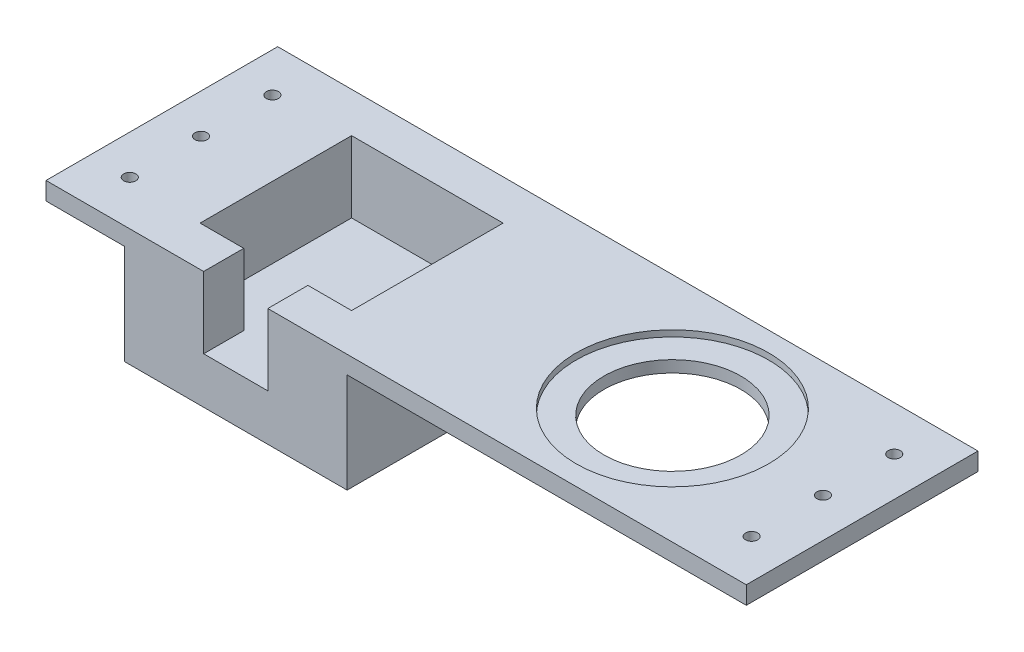
ISO-10303-21;
HEADER;
FILE_DESCRIPTION(('STEP AP214'),'2;1');
FILE_NAME('part.step','',(''),(''),'','','');
FILE_SCHEMA(('AUTOMOTIVE_DESIGN { 1 0 10303 214 1 1 1 1 }'));
ENDSEC;
DATA;
#1=APPLICATION_CONTEXT('core data for automotive mechanical design processes');
#2=APPLICATION_PROTOCOL_DEFINITION('international standard','automotive_design',2000,#1);
#3=PRODUCT_CONTEXT('',#1,'mechanical');
#4=PRODUCT('Part','Part','',(#3));
#5=PRODUCT_RELATED_PRODUCT_CATEGORY('part','',(#4));
#6=PRODUCT_DEFINITION_FORMATION('','',#4);
#7=PRODUCT_DEFINITION_CONTEXT('part definition',#1,'design');
#8=PRODUCT_DEFINITION('design','',#6,#7);
#9=PRODUCT_DEFINITION_SHAPE('','',#8);
#10=(LENGTH_UNIT() NAMED_UNIT(*) SI_UNIT(.MILLI.,.METRE.));
#11=(NAMED_UNIT(*) PLANE_ANGLE_UNIT() SI_UNIT($,.RADIAN.));
#12=(NAMED_UNIT(*) SI_UNIT($,.STERADIAN.) SOLID_ANGLE_UNIT());
#13=UNCERTAINTY_MEASURE_WITH_UNIT(LENGTH_MEASURE(1.E-05),#10,'distance_accuracy_value','');
#14=(GEOMETRIC_REPRESENTATION_CONTEXT(3) GLOBAL_UNCERTAINTY_ASSIGNED_CONTEXT((#13)) GLOBAL_UNIT_ASSIGNED_CONTEXT((#10,
#11,#12)) REPRESENTATION_CONTEXT('',''));
#15=CARTESIAN_POINT('',(0.,0.,0.));
#16=DIRECTION('',(0.,0.,1.));
#17=DIRECTION('',(1.,0.,0.));
#18=AXIS2_PLACEMENT_3D('',#15,#16,#17);
#19=CARTESIAN_POINT('',(0.,0.,0.));
#20=DIRECTION('',(0.,1.,0.));
#21=DIRECTION('',(0.,0.,1.));
#22=AXIS2_PLACEMENT_3D('',#19,#20,#21);
#23=PLANE('',#22);
#24=CARTESIAN_POINT('',(-87.225,0.,-20.));
#25=DIRECTION('',(0.,1.,0.));
#26=DIRECTION('',(0.,0.,1.));
#27=AXIS2_PLACEMENT_3D('',#24,#25,#26);
#28=CIRCLE('',#27,1.69999999999999);
#29=CARTESIAN_POINT('',(-87.225,0.,-18.3));
#30=VERTEX_POINT('',#29);
#31=EDGE_CURVE('E567',#30,#30,#28,.T.);
#32=ORIENTED_EDGE('',*,*,#31,.T.);
#33=EDGE_LOOP('',(#32));
#34=FACE_BOUND('',#33,.T.);
#35=CARTESIAN_POINT('',(-87.225,0.,0.));
#36=DIRECTION('',(0.,1.,0.));
#37=DIRECTION('',(0.,0.,1.));
#38=AXIS2_PLACEMENT_3D('',#35,#36,#37);
#39=CIRCLE('',#38,1.69999999999999);
#40=CARTESIAN_POINT('',(-87.225,0.,1.69999999999999));
#41=VERTEX_POINT('',#40);
#42=EDGE_CURVE('E571',#41,#41,#39,.T.);
#43=ORIENTED_EDGE('',*,*,#42,.T.);
#44=EDGE_LOOP('',(#43));
#45=FACE_BOUND('',#44,.T.);
#46=CARTESIAN_POINT('',(-87.225,0.,20.));
#47=DIRECTION('',(0.,1.,0.));
#48=DIRECTION('',(0.,0.,1.));
#49=AXIS2_PLACEMENT_3D('',#46,#47,#48);
#50=CIRCLE('',#49,1.69999999999999);
#51=CARTESIAN_POINT('',(-87.225,0.,21.7));
#52=VERTEX_POINT('',#51);
#53=EDGE_CURVE('E579',#52,#52,#50,.T.);
#54=ORIENTED_EDGE('',*,*,#53,.T.);
#55=EDGE_LOOP('',(#54));
#56=FACE_BOUND('',#55,.T.);
#57=DIRECTION('',(0.,0.,-1.));
#58=VECTOR('',#57,1.);
#59=CARTESIAN_POINT('',(-76.25,0.,0.));
#60=LINE('',#59,#58);
#61=CARTESIAN_POINT('',(-76.25,0.,32.5));
#62=VERTEX_POINT('',#61);
#63=CARTESIAN_POINT('',(-76.25,0.,-32.5));
#64=VERTEX_POINT('',#63);
#65=EDGE_CURVE('E68',#62,#64,#60,.T.);
#66=ORIENTED_EDGE('',*,*,#65,.F.);
#67=DIRECTION('',(-1.,0.,0.));
#68=VECTOR('',#67,1.);
#69=CARTESIAN_POINT('',(98.225,0.,32.5));
#70=LINE('',#69,#68);
#71=CARTESIAN_POINT('',(-98.225,0.,32.5));
#72=VERTEX_POINT('',#71);
#73=EDGE_CURVE('E276',#62,#72,#70,.T.);
#74=ORIENTED_EDGE('',*,*,#73,.T.);
#75=DIRECTION('',(0.,0.,1.));
#76=VECTOR('',#75,1.);
#77=CARTESIAN_POINT('',(-98.225,0.,-32.5));
#78=LINE('',#77,#76);
#79=CARTESIAN_POINT('',(-98.225,0.,-32.5));
#80=VERTEX_POINT('',#79);
#81=EDGE_CURVE('E273',#80,#72,#78,.T.);
#82=ORIENTED_EDGE('',*,*,#81,.F.);
#83=DIRECTION('',(-1.,0.,0.));
#84=VECTOR('',#83,1.);
#85=CARTESIAN_POINT('',(98.225,0.,-32.5));
#86=LINE('',#85,#84);
#87=EDGE_CURVE('E233',#64,#80,#86,.T.);
#88=ORIENTED_EDGE('',*,*,#87,.F.);
#89=EDGE_LOOP('',(#66,#74,#82,#88));
#90=FACE_BOUND('',#89,.T.);
#91=ADVANCED_FACE('F43',(#34,#45,#56,#90),#23,.F.);
#92=CARTESIAN_POINT('',(98.225,5.,-32.5));
#93=DIRECTION('',(0.,0.,1.));
#94=DIRECTION('',(1.,0.,0.));
#95=AXIS2_PLACEMENT_3D('',#92,#93,#94);
#96=PLANE('',#95);
#97=CARTESIAN_POINT('',(98.225,0.,-32.5));
#98=VERTEX_POINT('',#97);
#99=CARTESIAN_POINT('',(-13.75,0.,-32.5));
#100=VERTEX_POINT('',#99);
#101=EDGE_CURVE('E270',#98,#100,#86,.T.);
#102=ORIENTED_EDGE('',*,*,#101,.T.);
#103=DIRECTION('',(0.,1.,0.));
#104=VECTOR('',#103,1.);
#105=CARTESIAN_POINT('',(-13.75,-28.,-32.5));
#106=LINE('',#105,#104);
#107=CARTESIAN_POINT('',(-13.75,-28.,-32.5));
#108=VERTEX_POINT('',#107);
#109=EDGE_CURVE('E252',#108,#100,#106,.T.);
#110=ORIENTED_EDGE('',*,*,#109,.F.);
#111=DIRECTION('',(-1.,0.,0.));
#112=VECTOR('',#111,1.);
#113=CARTESIAN_POINT('',(0.,-28.,-32.5));
#114=LINE('',#113,#112);
#115=CARTESIAN_POINT('',(-76.25,-28.,-32.5));
#116=VERTEX_POINT('',#115);
#117=EDGE_CURVE('E224',#108,#116,#114,.T.);
#118=ORIENTED_EDGE('',*,*,#117,.T.);
#119=DIRECTION('',(0.,1.,0.));
#120=VECTOR('',#119,1.);
#121=CARTESIAN_POINT('',(-76.25,-28.,-32.5));
#122=LINE('',#121,#120);
#123=EDGE_CURVE('E249',#116,#64,#122,.T.);
#124=ORIENTED_EDGE('',*,*,#123,.T.);
#125=ORIENTED_EDGE('',*,*,#87,.T.);
#126=DIRECTION('',(0.,-1.,0.));
#127=VECTOR('',#126,1.);
#128=CARTESIAN_POINT('',(-98.225,5.,-32.5));
#129=LINE('',#128,#127);
#130=CARTESIAN_POINT('',(-98.225,5.,-32.5));
#131=VERTEX_POINT('',#130);
#132=EDGE_CURVE('E11',#131,#80,#129,.T.);
#133=ORIENTED_EDGE('',*,*,#132,.F.);
#134=DIRECTION('',(-1.,0.,0.));
#135=VECTOR('',#134,1.);
#136=CARTESIAN_POINT('',(98.225,5.,-32.5));
#137=LINE('',#136,#135);
#138=CARTESIAN_POINT('',(98.225,5.,-32.5));
#139=VERTEX_POINT('',#138);
#140=EDGE_CURVE('E257',#139,#131,#137,.T.);
#141=ORIENTED_EDGE('',*,*,#140,.F.);
#142=DIRECTION('',(0.,-1.,0.));
#143=VECTOR('',#142,1.);
#144=CARTESIAN_POINT('',(98.225,5.,-32.5));
#145=LINE('',#144,#143);
#146=EDGE_CURVE('E269',#139,#98,#145,.T.);
#147=ORIENTED_EDGE('',*,*,#146,.T.);
#148=EDGE_LOOP('',(#102,#110,#118,#124,#125,#133,#141,#147));
#149=FACE_BOUND('',#148,.T.);
#150=ADVANCED_FACE('F45',(#149),#96,.F.);
#151=CARTESIAN_POINT('',(-98.225,5.,-32.5));
#152=DIRECTION('',(1.,0.,0.));
#153=DIRECTION('',(0.,0.,-1.));
#154=AXIS2_PLACEMENT_3D('',#151,#152,#153);
#155=PLANE('',#154);
#156=ORIENTED_EDGE('',*,*,#81,.T.);
#157=DIRECTION('',(0.,-1.,0.));
#158=VECTOR('',#157,1.);
#159=CARTESIAN_POINT('',(-98.225,5.,32.5));
#160=LINE('',#159,#158);
#161=CARTESIAN_POINT('',(-98.225,5.,32.5));
#162=VERTEX_POINT('',#161);
#163=EDGE_CURVE('E52',#162,#72,#160,.T.);
#164=ORIENTED_EDGE('',*,*,#163,.F.);
#165=DIRECTION('',(0.,0.,1.));
#166=VECTOR('',#165,1.);
#167=CARTESIAN_POINT('',(-98.225,5.,-32.5));
#168=LINE('',#167,#166);
#169=EDGE_CURVE('E260',#131,#162,#168,.T.);
#170=ORIENTED_EDGE('',*,*,#169,.F.);
#171=ORIENTED_EDGE('',*,*,#132,.T.);
#172=EDGE_LOOP('',(#156,#164,#170,#171));
#173=FACE_BOUND('',#172,.T.);
#174=ADVANCED_FACE('F358',(#173),#155,.F.);
#175=CARTESIAN_POINT('',(98.225,5.,32.5));
#176=DIRECTION('',(0.,0.,1.));
#177=DIRECTION('',(1.,0.,0.));
#178=AXIS2_PLACEMENT_3D('',#175,#176,#177);
#179=PLANE('',#178);
#180=DIRECTION('',(0.,1.,0.));
#181=VECTOR('',#180,1.);
#182=CARTESIAN_POINT('',(-54.,-28.,32.5));
#183=LINE('',#182,#181);
#184=CARTESIAN_POINT('',(-54.,-15.,32.5));
#185=VERTEX_POINT('',#184);
#186=CARTESIAN_POINT('',(-54.,5.,32.5));
#187=VERTEX_POINT('',#186);
#188=EDGE_CURVE('E244',#185,#187,#183,.T.);
#189=ORIENTED_EDGE('',*,*,#188,.T.);
#190=DIRECTION('',(-1.,0.,0.));
#191=VECTOR('',#190,1.);
#192=CARTESIAN_POINT('',(98.225,5.,32.5));
#193=LINE('',#192,#191);
#194=EDGE_CURVE('E264',#187,#162,#193,.T.);
#195=ORIENTED_EDGE('',*,*,#194,.T.);
#196=ORIENTED_EDGE('',*,*,#163,.T.);
#197=ORIENTED_EDGE('',*,*,#73,.F.);
#198=DIRECTION('',(0.,1.,0.));
#199=VECTOR('',#198,1.);
#200=CARTESIAN_POINT('',(-76.25,-28.,32.5));
#201=LINE('',#200,#199);
#202=CARTESIAN_POINT('',(-76.25,-28.,32.5));
#203=VERTEX_POINT('',#202);
#204=EDGE_CURVE('E246',#203,#62,#201,.T.);
#205=ORIENTED_EDGE('',*,*,#204,.F.);
#206=DIRECTION('',(1.,0.,0.));
#207=VECTOR('',#206,1.);
#208=CARTESIAN_POINT('',(0.,-28.,32.5));
#209=LINE('',#208,#207);
#210=CARTESIAN_POINT('',(-13.75,-28.,32.5));
#211=VERTEX_POINT('',#210);
#212=EDGE_CURVE('E165',#203,#211,#209,.T.);
#213=ORIENTED_EDGE('',*,*,#212,.T.);
#214=DIRECTION('',(0.,1.,0.));
#215=VECTOR('',#214,1.);
#216=CARTESIAN_POINT('',(-13.75,-28.,32.5));
#217=LINE('',#216,#215);
#218=CARTESIAN_POINT('',(-13.75,0.,32.5));
#219=VERTEX_POINT('',#218);
#220=EDGE_CURVE('E164',#211,#219,#217,.T.);
#221=ORIENTED_EDGE('',*,*,#220,.T.);
#222=CARTESIAN_POINT('',(98.225,0.,32.5));
#223=VERTEX_POINT('',#222);
#224=EDGE_CURVE('E277',#223,#219,#70,.T.);
#225=ORIENTED_EDGE('',*,*,#224,.F.);
#226=DIRECTION('',(0.,-1.,0.));
#227=VECTOR('',#226,1.);
#228=CARTESIAN_POINT('',(98.225,5.,32.5));
#229=LINE('',#228,#227);
#230=CARTESIAN_POINT('',(98.225,5.,32.5));
#231=VERTEX_POINT('',#230);
#232=EDGE_CURVE('E282',#231,#223,#229,.T.);
#233=ORIENTED_EDGE('',*,*,#232,.F.);
#234=CARTESIAN_POINT('',(-36.,5.,32.5));
#235=VERTEX_POINT('',#234);
#236=EDGE_CURVE('E163',#231,#235,#193,.T.);
#237=ORIENTED_EDGE('',*,*,#236,.T.);
#238=DIRECTION('',(0.,1.,0.));
#239=VECTOR('',#238,1.);
#240=CARTESIAN_POINT('',(-36.,-28.,32.5));
#241=LINE('',#240,#239);
#242=CARTESIAN_POINT('',(-36.,-15.,32.5));
#243=VERTEX_POINT('',#242);
#244=EDGE_CURVE('E60',#243,#235,#241,.T.);
#245=ORIENTED_EDGE('',*,*,#244,.F.);
#246=DIRECTION('',(1.,0.,0.));
#247=VECTOR('',#246,1.);
#248=CARTESIAN_POINT('',(0.,-15.,32.5));
#249=LINE('',#248,#247);
#250=EDGE_CURVE('E161',#185,#243,#249,.T.);
#251=ORIENTED_EDGE('',*,*,#250,.F.);
#252=EDGE_LOOP('',(#189,#195,#196,#197,#205,#213,#221,#225,#233,#237,#245,#251));
#253=FACE_BOUND('',#252,.T.);
#254=ADVANCED_FACE('F159',(#253),#179,.T.);
#255=CARTESIAN_POINT('',(98.225,5.,-32.5));
#256=DIRECTION('',(1.,0.,0.));
#257=DIRECTION('',(0.,0.,-1.));
#258=AXIS2_PLACEMENT_3D('',#255,#256,#257);
#259=PLANE('',#258);
#260=DIRECTION('',(0.,0.,1.));
#261=VECTOR('',#260,1.);
#262=CARTESIAN_POINT('',(98.225,0.,-32.5));
#263=LINE('',#262,#261);
#264=EDGE_CURVE('E261',#98,#223,#263,.T.);
#265=ORIENTED_EDGE('',*,*,#264,.F.);
#266=ORIENTED_EDGE('',*,*,#146,.F.);
#267=DIRECTION('',(0.,0.,1.));
#268=VECTOR('',#267,1.);
#269=CARTESIAN_POINT('',(98.225,5.,-32.5));
#270=LINE('',#269,#268);
#271=EDGE_CURVE('E266',#139,#231,#270,.T.);
#272=ORIENTED_EDGE('',*,*,#271,.T.);
#273=ORIENTED_EDGE('',*,*,#232,.T.);
#274=EDGE_LOOP('',(#265,#266,#272,#273));
#275=FACE_BOUND('',#274,.T.);
#276=ADVANCED_FACE('F322',(#275),#259,.T.);
#277=CARTESIAN_POINT('',(0.,5.,0.));
#278=DIRECTION('',(0.,1.,0.));
#279=DIRECTION('',(0.,0.,1.));
#280=AXIS2_PLACEMENT_3D('',#277,#278,#279);
#281=PLANE('',#280);
#282=CARTESIAN_POINT('',(-87.225,5.,-20.));
#283=DIRECTION('',(0.,1.,0.));
#284=DIRECTION('',(0.,0.,1.));
#285=AXIS2_PLACEMENT_3D('',#282,#283,#284);
#286=CIRCLE('',#285,1.69999999999999);
#287=CARTESIAN_POINT('',(-87.225,5.,-18.3));
#288=VERTEX_POINT('',#287);
#289=EDGE_CURVE('E565',#288,#288,#286,.T.);
#290=ORIENTED_EDGE('',*,*,#289,.F.);
#291=EDGE_LOOP('',(#290));
#292=FACE_BOUND('',#291,.T.);
#293=CARTESIAN_POINT('',(-87.225,5.,0.));
#294=DIRECTION('',(0.,1.,0.));
#295=DIRECTION('',(0.,0.,1.));
#296=AXIS2_PLACEMENT_3D('',#293,#294,#295);
#297=CIRCLE('',#296,1.69999999999999);
#298=CARTESIAN_POINT('',(-87.225,5.,1.69999999999999));
#299=VERTEX_POINT('',#298);
#300=EDGE_CURVE('E568',#299,#299,#297,.T.);
#301=ORIENTED_EDGE('',*,*,#300,.F.);
#302=EDGE_LOOP('',(#301));
#303=FACE_BOUND('',#302,.T.);
#304=CARTESIAN_POINT('',(-87.225,5.,20.));
#305=DIRECTION('',(0.,1.,0.));
#306=DIRECTION('',(0.,0.,1.));
#307=AXIS2_PLACEMENT_3D('',#304,#305,#306);
#308=CIRCLE('',#307,1.69999999999999);
#309=CARTESIAN_POINT('',(-87.225,5.,21.7));
#310=VERTEX_POINT('',#309);
#311=EDGE_CURVE('E577',#310,#310,#308,.T.);
#312=ORIENTED_EDGE('',*,*,#311,.F.);
#313=EDGE_LOOP('',(#312));
#314=FACE_BOUND('',#313,.T.);
#315=CARTESIAN_POINT('',(87.225,5.,20.));
#316=DIRECTION('',(0.,1.,0.));
#317=DIRECTION('',(0.,0.,1.));
#318=AXIS2_PLACEMENT_3D('',#315,#316,#317);
#319=CIRCLE('',#318,1.69999999999999);
#320=CARTESIAN_POINT('',(87.225,5.,21.7));
#321=VERTEX_POINT('',#320);
#322=EDGE_CURVE('E305',#321,#321,#319,.T.);
#323=ORIENTED_EDGE('',*,*,#322,.F.);
#324=EDGE_LOOP('',(#323));
#325=FACE_BOUND('',#324,.T.);
#326=CARTESIAN_POINT('',(87.225,5.,0.));
#327=DIRECTION('',(0.,1.,0.));
#328=DIRECTION('',(0.,0.,1.));
#329=AXIS2_PLACEMENT_3D('',#326,#327,#328);
#330=CIRCLE('',#329,1.69999999999999);
#331=CARTESIAN_POINT('',(87.225,5.,1.69999999999998));
#332=VERTEX_POINT('',#331);
#333=EDGE_CURVE('E295',#332,#332,#330,.T.);
#334=ORIENTED_EDGE('',*,*,#333,.F.);
#335=EDGE_LOOP('',(#334));
#336=FACE_BOUND('',#335,.T.);
#337=CARTESIAN_POINT('',(87.225,5.,-20.));
#338=DIRECTION('',(0.,1.,0.));
#339=DIRECTION('',(0.,0.,1.));
#340=AXIS2_PLACEMENT_3D('',#337,#338,#339);
#341=CIRCLE('',#340,1.69999999999999);
#342=CARTESIAN_POINT('',(87.225,5.,-18.3));
#343=VERTEX_POINT('',#342);
#344=EDGE_CURVE('E292',#343,#343,#341,.T.);
#345=ORIENTED_EDGE('',*,*,#344,.F.);
#346=EDGE_LOOP('',(#345));
#347=FACE_BOUND('',#346,.T.);
#348=CARTESIAN_POINT('',(45.,5.,0.));
#349=DIRECTION('',(0.,1.,0.));
#350=DIRECTION('',(0.,0.,1.));
#351=AXIS2_PLACEMENT_3D('',#348,#349,#350);
#352=CIRCLE('',#351,26.99);
#353=CARTESIAN_POINT('',(45.,5.,26.99));
#354=VERTEX_POINT('',#353);
#355=EDGE_CURVE('E187',#354,#354,#352,.T.);
#356=ORIENTED_EDGE('',*,*,#355,.F.);
#357=EDGE_LOOP('',(#356));
#358=FACE_BOUND('',#357,.T.);
#359=DIRECTION('',(0.,0.,1.));
#360=VECTOR('',#359,1.);
#361=CARTESIAN_POINT('',(-54.,5.,0.));
#362=LINE('',#361,#360);
#363=CARTESIAN_POINT('',(-54.,5.,21.25));
#364=VERTEX_POINT('',#363);
#365=EDGE_CURVE('E181',#364,#187,#362,.T.);
#366=ORIENTED_EDGE('',*,*,#365,.F.);
#367=DIRECTION('',(1.,0.,0.));
#368=VECTOR('',#367,1.);
#369=CARTESIAN_POINT('',(0.,5.,21.25));
#370=LINE('',#369,#368);
#371=CARTESIAN_POINT('',(-66.25,5.,21.25));
#372=VERTEX_POINT('',#371);
#373=EDGE_CURVE('E184',#372,#364,#370,.T.);
#374=ORIENTED_EDGE('',*,*,#373,.F.);
#375=DIRECTION('',(0.,0.,1.));
#376=VECTOR('',#375,1.);
#377=CARTESIAN_POINT('',(-66.25,5.,0.));
#378=LINE('',#377,#376);
#379=CARTESIAN_POINT('',(-66.25,5.,-21.25));
#380=VERTEX_POINT('',#379);
#381=EDGE_CURVE('E216',#380,#372,#378,.T.);
#382=ORIENTED_EDGE('',*,*,#381,.F.);
#383=DIRECTION('',(-1.,0.,0.));
#384=VECTOR('',#383,1.);
#385=CARTESIAN_POINT('',(0.,5.,-21.25));
#386=LINE('',#385,#384);
#387=CARTESIAN_POINT('',(-23.75,5.,-21.25));
#388=VERTEX_POINT('',#387);
#389=EDGE_CURVE('E213',#388,#380,#386,.T.);
#390=ORIENTED_EDGE('',*,*,#389,.F.);
#391=DIRECTION('',(0.,0.,-1.));
#392=VECTOR('',#391,1.);
#393=CARTESIAN_POINT('',(-23.75,5.,0.));
#394=LINE('',#393,#392);
#395=CARTESIAN_POINT('',(-23.75,5.,21.25));
#396=VERTEX_POINT('',#395);
#397=EDGE_CURVE('E210',#396,#388,#394,.T.);
#398=ORIENTED_EDGE('',*,*,#397,.F.);
#399=DIRECTION('',(1.,0.,0.));
#400=VECTOR('',#399,1.);
#401=CARTESIAN_POINT('',(0.,5.,21.25));
#402=LINE('',#401,#400);
#403=CARTESIAN_POINT('',(-36.,5.,21.25));
#404=VERTEX_POINT('',#403);
#405=EDGE_CURVE('E206',#404,#396,#402,.T.);
#406=ORIENTED_EDGE('',*,*,#405,.F.);
#407=DIRECTION('',(0.,0.,-1.));
#408=VECTOR('',#407,1.);
#409=CARTESIAN_POINT('',(-36.,5.,0.));
#410=LINE('',#409,#408);
#411=EDGE_CURVE('E204',#235,#404,#410,.T.);
#412=ORIENTED_EDGE('',*,*,#411,.F.);
#413=ORIENTED_EDGE('',*,*,#236,.F.);
#414=ORIENTED_EDGE('',*,*,#271,.F.);
#415=ORIENTED_EDGE('',*,*,#140,.T.);
#416=ORIENTED_EDGE('',*,*,#169,.T.);
#417=ORIENTED_EDGE('',*,*,#194,.F.);
#418=EDGE_LOOP('',(#366,#374,#382,#390,#398,#406,#412,#413,#414,#415,#416,#417));
#419=FACE_BOUND('',#418,.T.);
#420=ADVANCED_FACE('F318',(#292,#303,#314,#325,#336,#347,#358,#419),#281,.T.);
#421=CARTESIAN_POINT('',(87.225,0.,20.));
#422=DIRECTION('',(0.,1.,0.));
#423=DIRECTION('',(0.,0.,1.));
#424=AXIS2_PLACEMENT_3D('',#421,#422,#423);
#425=CIRCLE('',#424,1.69999999999999);
#426=CARTESIAN_POINT('',(87.225,0.,21.7));
#427=VERTEX_POINT('',#426);
#428=EDGE_CURVE('E47',#427,#427,#425,.T.);
#429=ORIENTED_EDGE('',*,*,#428,.T.);
#430=EDGE_LOOP('',(#429));
#431=FACE_BOUND('',#430,.T.);
#432=CARTESIAN_POINT('',(87.225,0.,0.));
#433=DIRECTION('',(0.,1.,0.));
#434=DIRECTION('',(0.,0.,1.));
#435=AXIS2_PLACEMENT_3D('',#432,#433,#434);
#436=CIRCLE('',#435,1.69999999999999);
#437=CARTESIAN_POINT('',(87.225,0.,1.69999999999998));
#438=VERTEX_POINT('',#437);
#439=EDGE_CURVE('E293',#438,#438,#436,.T.);
#440=ORIENTED_EDGE('',*,*,#439,.T.);
#441=EDGE_LOOP('',(#440));
#442=FACE_BOUND('',#441,.T.);
#443=CARTESIAN_POINT('',(87.225,0.,-20.));
#444=DIRECTION('',(0.,1.,0.));
#445=DIRECTION('',(0.,0.,1.));
#446=AXIS2_PLACEMENT_3D('',#443,#444,#445);
#447=CIRCLE('',#446,1.69999999999999);
#448=CARTESIAN_POINT('',(87.225,0.,-18.3));
#449=VERTEX_POINT('',#448);
#450=EDGE_CURVE('E290',#449,#449,#447,.T.);
#451=ORIENTED_EDGE('',*,*,#450,.T.);
#452=EDGE_LOOP('',(#451));
#453=FACE_BOUND('',#452,.T.);
#454=CARTESIAN_POINT('',(45.,0.,0.));
#455=DIRECTION('',(0.,1.,0.));
#456=DIRECTION('',(0.,0.,1.));
#457=AXIS2_PLACEMENT_3D('',#454,#455,#456);
#458=CIRCLE('',#457,19.2);
#459=CARTESIAN_POINT('',(45.,0.,19.2));
#460=VERTEX_POINT('',#459);
#461=EDGE_CURVE('E289',#460,#460,#458,.T.);
#462=ORIENTED_EDGE('',*,*,#461,.T.);
#463=EDGE_LOOP('',(#462));
#464=FACE_BOUND('',#463,.T.);
#465=ORIENTED_EDGE('',*,*,#224,.T.);
#466=DIRECTION('',(0.,0.,-1.));
#467=VECTOR('',#466,1.);
#468=CARTESIAN_POINT('',(-13.75,0.,0.));
#469=LINE('',#468,#467);
#470=EDGE_CURVE('E203',#219,#100,#469,.T.);
#471=ORIENTED_EDGE('',*,*,#470,.T.);
#472=ORIENTED_EDGE('',*,*,#101,.F.);
#473=ORIENTED_EDGE('',*,*,#264,.T.);
#474=EDGE_LOOP('',(#465,#471,#472,#473));
#475=FACE_BOUND('',#474,.T.);
#476=ADVANCED_FACE('F321',(#431,#442,#453,#464,#475),#23,.F.);
#477=CARTESIAN_POINT('',(-36.,-28.,0.));
#478=DIRECTION('',(1.,0.,0.));
#479=DIRECTION('',(0.,0.,-1.));
#480=AXIS2_PLACEMENT_3D('',#477,#478,#479);
#481=PLANE('',#480);
#482=DIRECTION('',(0.,1.,0.));
#483=VECTOR('',#482,1.);
#484=CARTESIAN_POINT('',(-36.,-28.,21.25));
#485=LINE('',#484,#483);
#486=CARTESIAN_POINT('',(-36.,-15.,21.25));
#487=VERTEX_POINT('',#486);
#488=EDGE_CURVE('E170',#487,#404,#485,.T.);
#489=ORIENTED_EDGE('',*,*,#488,.F.);
#490=DIRECTION('',(0.,0.,-1.));
#491=VECTOR('',#490,1.);
#492=CARTESIAN_POINT('',(-36.,-15.,0.));
#493=LINE('',#492,#491);
#494=EDGE_CURVE('E168',#243,#487,#493,.T.);
#495=ORIENTED_EDGE('',*,*,#494,.F.);
#496=ORIENTED_EDGE('',*,*,#244,.T.);
#497=ORIENTED_EDGE('',*,*,#411,.T.);
#498=EDGE_LOOP('',(#489,#495,#496,#497));
#499=FACE_BOUND('',#498,.T.);
#500=ADVANCED_FACE('F169',(#499),#481,.F.);
#501=CARTESIAN_POINT('',(0.,-28.,21.25));
#502=DIRECTION('',(0.,0.,1.));
#503=DIRECTION('',(1.,0.,0.));
#504=AXIS2_PLACEMENT_3D('',#501,#502,#503);
#505=PLANE('',#504);
#506=DIRECTION('',(0.,1.,0.));
#507=VECTOR('',#506,1.);
#508=CARTESIAN_POINT('',(-23.75,-28.,21.25));
#509=LINE('',#508,#507);
#510=CARTESIAN_POINT('',(-23.75,-15.,21.25));
#511=VERTEX_POINT('',#510);
#512=EDGE_CURVE('E234',#511,#396,#509,.T.);
#513=ORIENTED_EDGE('',*,*,#512,.F.);
#514=DIRECTION('',(1.,0.,0.));
#515=VECTOR('',#514,1.);
#516=CARTESIAN_POINT('',(0.,-15.,21.25));
#517=LINE('',#516,#515);
#518=EDGE_CURVE('E174',#487,#511,#517,.T.);
#519=ORIENTED_EDGE('',*,*,#518,.F.);
#520=ORIENTED_EDGE('',*,*,#488,.T.);
#521=ORIENTED_EDGE('',*,*,#405,.T.);
#522=EDGE_LOOP('',(#513,#519,#520,#521));
#523=FACE_BOUND('',#522,.T.);
#524=ADVANCED_FACE('F347',(#523),#505,.F.);
#525=CARTESIAN_POINT('',(-23.75,-28.,0.));
#526=DIRECTION('',(1.,0.,0.));
#527=DIRECTION('',(0.,0.,-1.));
#528=AXIS2_PLACEMENT_3D('',#525,#526,#527);
#529=PLANE('',#528);
#530=DIRECTION('',(0.,1.,0.));
#531=VECTOR('',#530,1.);
#532=CARTESIAN_POINT('',(-23.75,-28.,-21.25));
#533=LINE('',#532,#531);
#534=CARTESIAN_POINT('',(-23.75,-15.,-21.25));
#535=VERTEX_POINT('',#534);
#536=EDGE_CURVE('E236',#535,#388,#533,.T.);
#537=ORIENTED_EDGE('',*,*,#536,.F.);
#538=DIRECTION('',(0.,0.,-1.));
#539=VECTOR('',#538,1.);
#540=CARTESIAN_POINT('',(-23.75,-15.,0.));
#541=LINE('',#540,#539);
#542=EDGE_CURVE('E191',#511,#535,#541,.T.);
#543=ORIENTED_EDGE('',*,*,#542,.F.);
#544=ORIENTED_EDGE('',*,*,#512,.T.);
#545=ORIENTED_EDGE('',*,*,#397,.T.);
#546=EDGE_LOOP('',(#537,#543,#544,#545));
#547=FACE_BOUND('',#546,.T.);
#548=ADVANCED_FACE('F345',(#547),#529,.F.);
#549=CARTESIAN_POINT('',(0.,-28.,-21.25));
#550=DIRECTION('',(0.,0.,1.));
#551=DIRECTION('',(1.,0.,0.));
#552=AXIS2_PLACEMENT_3D('',#549,#550,#551);
#553=PLANE('',#552);
#554=DIRECTION('',(0.,1.,0.));
#555=VECTOR('',#554,1.);
#556=CARTESIAN_POINT('',(-66.25,-28.,-21.25));
#557=LINE('',#556,#555);
#558=CARTESIAN_POINT('',(-66.25,-15.,-21.25));
#559=VERTEX_POINT('',#558);
#560=EDGE_CURVE('E238',#559,#380,#557,.T.);
#561=ORIENTED_EDGE('',*,*,#560,.F.);
#562=DIRECTION('',(-1.,0.,0.));
#563=VECTOR('',#562,1.);
#564=CARTESIAN_POINT('',(0.,-15.,-21.25));
#565=LINE('',#564,#563);
#566=EDGE_CURVE('E194',#535,#559,#565,.T.);
#567=ORIENTED_EDGE('',*,*,#566,.F.);
#568=ORIENTED_EDGE('',*,*,#536,.T.);
#569=ORIENTED_EDGE('',*,*,#389,.T.);
#570=EDGE_LOOP('',(#561,#567,#568,#569));
#571=FACE_BOUND('',#570,.T.);
#572=ADVANCED_FACE('F341',(#571),#553,.T.);
#573=CARTESIAN_POINT('',(-66.25,-28.,0.));
#574=DIRECTION('',(1.,0.,0.));
#575=DIRECTION('',(0.,0.,-1.));
#576=AXIS2_PLACEMENT_3D('',#573,#574,#575);
#577=PLANE('',#576);
#578=DIRECTION('',(0.,1.,0.));
#579=VECTOR('',#578,1.);
#580=CARTESIAN_POINT('',(-66.25,-28.,21.25));
#581=LINE('',#580,#579);
#582=CARTESIAN_POINT('',(-66.25,-15.,21.25));
#583=VERTEX_POINT('',#582);
#584=EDGE_CURVE('E240',#583,#372,#581,.T.);
#585=ORIENTED_EDGE('',*,*,#584,.F.);
#586=DIRECTION('',(0.,0.,1.));
#587=VECTOR('',#586,1.);
#588=CARTESIAN_POINT('',(-66.25,-15.,0.));
#589=LINE('',#588,#587);
#590=EDGE_CURVE('E197',#559,#583,#589,.T.);
#591=ORIENTED_EDGE('',*,*,#590,.F.);
#592=ORIENTED_EDGE('',*,*,#560,.T.);
#593=ORIENTED_EDGE('',*,*,#381,.T.);
#594=EDGE_LOOP('',(#585,#591,#592,#593));
#595=FACE_BOUND('',#594,.T.);
#596=ADVANCED_FACE('F336',(#595),#577,.T.);
#597=CARTESIAN_POINT('',(0.,-28.,21.25));
#598=DIRECTION('',(0.,0.,1.));
#599=DIRECTION('',(1.,0.,0.));
#600=AXIS2_PLACEMENT_3D('',#597,#598,#599);
#601=PLANE('',#600);
#602=DIRECTION('',(0.,1.,0.));
#603=VECTOR('',#602,1.);
#604=CARTESIAN_POINT('',(-54.,-28.,21.25));
#605=LINE('',#604,#603);
#606=CARTESIAN_POINT('',(-54.,-15.,21.25));
#607=VERTEX_POINT('',#606);
#608=EDGE_CURVE('E242',#607,#364,#605,.T.);
#609=ORIENTED_EDGE('',*,*,#608,.F.);
#610=DIRECTION('',(1.,0.,0.));
#611=VECTOR('',#610,1.);
#612=CARTESIAN_POINT('',(0.,-15.,21.25));
#613=LINE('',#612,#611);
#614=EDGE_CURVE('E200',#583,#607,#613,.T.);
#615=ORIENTED_EDGE('',*,*,#614,.F.);
#616=ORIENTED_EDGE('',*,*,#584,.T.);
#617=ORIENTED_EDGE('',*,*,#373,.T.);
#618=EDGE_LOOP('',(#609,#615,#616,#617));
#619=FACE_BOUND('',#618,.T.);
#620=ADVANCED_FACE('F333',(#619),#601,.F.);
#621=CARTESIAN_POINT('',(-54.,-28.,0.));
#622=DIRECTION('',(-1.,0.,0.));
#623=DIRECTION('',(0.,0.,1.));
#624=AXIS2_PLACEMENT_3D('',#621,#622,#623);
#625=PLANE('',#624);
#626=ORIENTED_EDGE('',*,*,#188,.F.);
#627=DIRECTION('',(0.,0.,1.));
#628=VECTOR('',#627,1.);
#629=CARTESIAN_POINT('',(-54.,-15.,0.));
#630=LINE('',#629,#628);
#631=EDGE_CURVE('E180',#607,#185,#630,.T.);
#632=ORIENTED_EDGE('',*,*,#631,.F.);
#633=ORIENTED_EDGE('',*,*,#608,.T.);
#634=ORIENTED_EDGE('',*,*,#365,.T.);
#635=EDGE_LOOP('',(#626,#632,#633,#634));
#636=FACE_BOUND('',#635,.T.);
#637=ADVANCED_FACE('F330',(#636),#625,.F.);
#638=CARTESIAN_POINT('',(-76.25,-28.,0.));
#639=DIRECTION('',(1.,0.,0.));
#640=DIRECTION('',(0.,0.,-1.));
#641=AXIS2_PLACEMENT_3D('',#638,#639,#640);
#642=PLANE('',#641);
#643=ORIENTED_EDGE('',*,*,#65,.T.);
#644=ORIENTED_EDGE('',*,*,#123,.F.);
#645=DIRECTION('',(0.,0.,-1.));
#646=VECTOR('',#645,1.);
#647=CARTESIAN_POINT('',(-76.25,-28.,0.));
#648=LINE('',#647,#646);
#649=EDGE_CURVE('E227',#203,#116,#648,.T.);
#650=ORIENTED_EDGE('',*,*,#649,.F.);
#651=ORIENTED_EDGE('',*,*,#204,.T.);
#652=EDGE_LOOP('',(#643,#644,#650,#651));
#653=FACE_BOUND('',#652,.T.);
#654=ADVANCED_FACE('F362',(#653),#642,.F.);
#655=CARTESIAN_POINT('',(-13.75,-28.,0.));
#656=DIRECTION('',(1.,0.,0.));
#657=DIRECTION('',(0.,0.,-1.));
#658=AXIS2_PLACEMENT_3D('',#655,#656,#657);
#659=PLANE('',#658);
#660=ORIENTED_EDGE('',*,*,#470,.F.);
#661=ORIENTED_EDGE('',*,*,#220,.F.);
#662=DIRECTION('',(0.,0.,-1.));
#663=VECTOR('',#662,1.);
#664=CARTESIAN_POINT('',(-13.75,-28.,0.));
#665=LINE('',#664,#663);
#666=EDGE_CURVE('E221',#211,#108,#665,.T.);
#667=ORIENTED_EDGE('',*,*,#666,.T.);
#668=ORIENTED_EDGE('',*,*,#109,.T.);
#669=EDGE_LOOP('',(#660,#661,#667,#668));
#670=FACE_BOUND('',#669,.T.);
#671=ADVANCED_FACE('F372',(#670),#659,.T.);
#672=CARTESIAN_POINT('',(0.,-28.,0.));
#673=DIRECTION('',(0.,1.,0.));
#674=DIRECTION('',(0.,0.,1.));
#675=AXIS2_PLACEMENT_3D('',#672,#673,#674);
#676=PLANE('',#675);
#677=ORIENTED_EDGE('',*,*,#666,.F.);
#678=ORIENTED_EDGE('',*,*,#212,.F.);
#679=ORIENTED_EDGE('',*,*,#649,.T.);
#680=ORIENTED_EDGE('',*,*,#117,.F.);
#681=EDGE_LOOP('',(#677,#678,#679,#680));
#682=FACE_BOUND('',#681,.T.);
#683=ADVANCED_FACE('F368',(#682),#676,.F.);
#684=CARTESIAN_POINT('',(0.,-15.,0.));
#685=DIRECTION('',(0.,1.,0.));
#686=DIRECTION('',(0.,0.,1.));
#687=AXIS2_PLACEMENT_3D('',#684,#685,#686);
#688=PLANE('',#687);
#689=ORIENTED_EDGE('',*,*,#250,.T.);
#690=ORIENTED_EDGE('',*,*,#494,.T.);
#691=ORIENTED_EDGE('',*,*,#518,.T.);
#692=ORIENTED_EDGE('',*,*,#542,.T.);
#693=ORIENTED_EDGE('',*,*,#566,.T.);
#694=ORIENTED_EDGE('',*,*,#590,.T.);
#695=ORIENTED_EDGE('',*,*,#614,.T.);
#696=ORIENTED_EDGE('',*,*,#631,.T.);
#697=EDGE_LOOP('',(#689,#690,#691,#692,#693,#694,#695,#696));
#698=FACE_BOUND('',#697,.T.);
#699=ADVANCED_FACE('F177',(#698),#688,.T.);
#700=CARTESIAN_POINT('',(45.,3.26,0.));
#701=DIRECTION('',(0.,1.,0.));
#702=DIRECTION('',(0.,0.,1.));
#703=AXIS2_PLACEMENT_3D('',#700,#701,#702);
#704=CYLINDRICAL_SURFACE('',#703,26.99);
#705=CARTESIAN_POINT('',(45.,3.26,0.));
#706=DIRECTION('',(0.,1.,0.));
#707=DIRECTION('',(0.,0.,1.));
#708=AXIS2_PLACEMENT_3D('',#705,#706,#707);
#709=CIRCLE('',#708,26.99);
#710=CARTESIAN_POINT('',(45.,3.26,26.99));
#711=VERTEX_POINT('',#710);
#712=EDGE_CURVE('E207',#711,#711,#709,.T.);
#713=ORIENTED_EDGE('',*,*,#712,.F.);
#714=EDGE_LOOP('',(#713));
#715=FACE_BOUND('',#714,.T.);
#716=ORIENTED_EDGE('',*,*,#355,.T.);
#717=EDGE_LOOP('',(#716));
#718=FACE_BOUND('',#717,.T.);
#719=ADVANCED_FACE('F316',(#715,#718),#704,.F.);
#720=CARTESIAN_POINT('',(45.,3.26,0.));
#721=DIRECTION('',(0.,1.,0.));
#722=DIRECTION('',(0.,0.,1.));
#723=AXIS2_PLACEMENT_3D('',#720,#721,#722);
#724=PLANE('',#723);
#725=CARTESIAN_POINT('',(45.,3.26,0.));
#726=DIRECTION('',(0.,1.,0.));
#727=DIRECTION('',(0.,0.,1.));
#728=AXIS2_PLACEMENT_3D('',#725,#726,#727);
#729=CIRCLE('',#728,19.2);
#730=CARTESIAN_POINT('',(45.,3.26,19.2));
#731=VERTEX_POINT('',#730);
#732=EDGE_CURVE('E286',#731,#731,#729,.F.);
#733=ORIENTED_EDGE('',*,*,#732,.T.);
#734=EDGE_LOOP('',(#733));
#735=FACE_BOUND('',#734,.T.);
#736=ORIENTED_EDGE('',*,*,#712,.T.);
#737=EDGE_LOOP('',(#736));
#738=FACE_BOUND('',#737,.T.);
#739=ADVANCED_FACE('F399',(#735,#738),#724,.T.);
#740=CARTESIAN_POINT('',(45.,20.,0.));
#741=DIRECTION('',(0.,-1.,0.));
#742=DIRECTION('',(0.,0.,-1.));
#743=AXIS2_PLACEMENT_3D('',#740,#741,#742);
#744=CYLINDRICAL_SURFACE('',#743,19.2);
#745=ORIENTED_EDGE('',*,*,#732,.F.);
#746=EDGE_LOOP('',(#745));
#747=FACE_BOUND('',#746,.T.);
#748=ORIENTED_EDGE('',*,*,#461,.F.);
#749=EDGE_LOOP('',(#748));
#750=FACE_BOUND('',#749,.T.);
#751=ADVANCED_FACE('F397',(#747,#750),#744,.F.);
#752=CARTESIAN_POINT('',(87.225,5.,-20.));
#753=DIRECTION('',(0.,1.,0.));
#754=DIRECTION('',(0.,0.,1.));
#755=AXIS2_PLACEMENT_3D('',#752,#753,#754);
#756=CYLINDRICAL_SURFACE('',#755,1.69999999999999);
#757=ORIENTED_EDGE('',*,*,#344,.T.);
#758=EDGE_LOOP('',(#757));
#759=FACE_BOUND('',#758,.T.);
#760=ORIENTED_EDGE('',*,*,#450,.F.);
#761=EDGE_LOOP('',(#760));
#762=FACE_BOUND('',#761,.T.);
#763=ADVANCED_FACE('F398',(#759,#762),#756,.F.);
#764=CARTESIAN_POINT('',(87.225,5.,0.));
#765=DIRECTION('',(0.,1.,0.));
#766=DIRECTION('',(0.,0.,1.));
#767=AXIS2_PLACEMENT_3D('',#764,#765,#766);
#768=CYLINDRICAL_SURFACE('',#767,1.69999999999999);
#769=ORIENTED_EDGE('',*,*,#333,.T.);
#770=EDGE_LOOP('',(#769));
#771=FACE_BOUND('',#770,.T.);
#772=ORIENTED_EDGE('',*,*,#439,.F.);
#773=EDGE_LOOP('',(#772));
#774=FACE_BOUND('',#773,.T.);
#775=ADVANCED_FACE('F405',(#771,#774),#768,.F.);
#776=CARTESIAN_POINT('',(87.225,5.,20.));
#777=DIRECTION('',(0.,1.,0.));
#778=DIRECTION('',(0.,0.,1.));
#779=AXIS2_PLACEMENT_3D('',#776,#777,#778);
#780=CYLINDRICAL_SURFACE('',#779,1.69999999999999);
#781=ORIENTED_EDGE('',*,*,#322,.T.);
#782=EDGE_LOOP('',(#781));
#783=FACE_BOUND('',#782,.T.);
#784=ORIENTED_EDGE('',*,*,#428,.F.);
#785=EDGE_LOOP('',(#784));
#786=FACE_BOUND('',#785,.T.);
#787=ADVANCED_FACE('F521',(#783,#786),#780,.F.);
#788=CARTESIAN_POINT('',(-87.225,5.,20.));
#789=DIRECTION('',(0.,1.,0.));
#790=DIRECTION('',(0.,0.,1.));
#791=AXIS2_PLACEMENT_3D('',#788,#789,#790);
#792=CYLINDRICAL_SURFACE('',#791,1.69999999999999);
#793=ORIENTED_EDGE('',*,*,#311,.T.);
#794=EDGE_LOOP('',(#793));
#795=FACE_BOUND('',#794,.T.);
#796=ORIENTED_EDGE('',*,*,#53,.F.);
#797=EDGE_LOOP('',(#796));
#798=FACE_BOUND('',#797,.T.);
#799=ADVANCED_FACE('F529',(#795,#798),#792,.F.);
#800=CARTESIAN_POINT('',(-87.225,5.,0.));
#801=DIRECTION('',(0.,1.,0.));
#802=DIRECTION('',(0.,0.,1.));
#803=AXIS2_PLACEMENT_3D('',#800,#801,#802);
#804=CYLINDRICAL_SURFACE('',#803,1.69999999999999);
#805=ORIENTED_EDGE('',*,*,#300,.T.);
#806=EDGE_LOOP('',(#805));
#807=FACE_BOUND('',#806,.T.);
#808=ORIENTED_EDGE('',*,*,#42,.F.);
#809=EDGE_LOOP('',(#808));
#810=FACE_BOUND('',#809,.T.);
#811=ADVANCED_FACE('F539',(#807,#810),#804,.F.);
#812=CARTESIAN_POINT('',(-87.225,5.,-20.));
#813=DIRECTION('',(0.,1.,0.));
#814=DIRECTION('',(0.,0.,1.));
#815=AXIS2_PLACEMENT_3D('',#812,#813,#814);
#816=CYLINDRICAL_SURFACE('',#815,1.69999999999999);
#817=ORIENTED_EDGE('',*,*,#289,.T.);
#818=EDGE_LOOP('',(#817));
#819=FACE_BOUND('',#818,.T.);
#820=ORIENTED_EDGE('',*,*,#31,.F.);
#821=EDGE_LOOP('',(#820));
#822=FACE_BOUND('',#821,.T.);
#823=ADVANCED_FACE('F549',(#819,#822),#816,.F.);
#824=CLOSED_SHELL('',(#91,#150,#174,#254,#276,#420,#476,#500,#524,#548,#572,#596,#620,#637,#654,
#671,#683,#699,#719,#739,#751,#763,#775,#787,#799,#811,#823));
#825=MANIFOLD_SOLID_BREP('B2',#824);
#826=ADVANCED_BREP_SHAPE_REPRESENTATION('',(#18,#825),#14);
#827=SHAPE_DEFINITION_REPRESENTATION(#9,#826);
ENDSEC;
END-ISO-10303-21;
